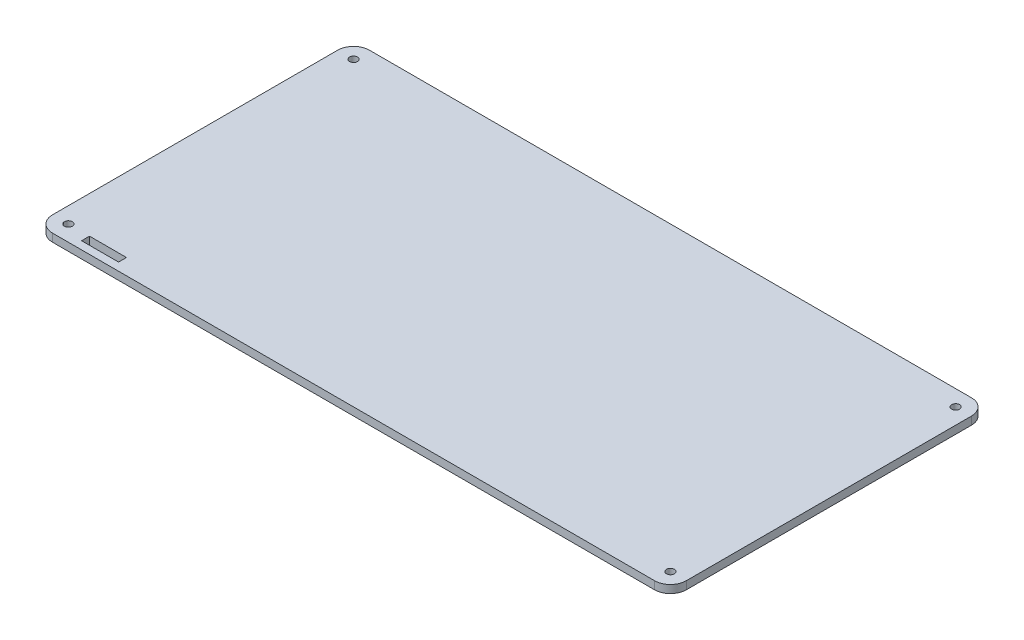
ISO-10303-21;
HEADER;
FILE_DESCRIPTION(('STEP AP214'),'2;1');
FILE_NAME('part.step','',(''),(''),'','','');
FILE_SCHEMA(('AUTOMOTIVE_DESIGN { 1 0 10303 214 1 1 1 1 }'));
ENDSEC;
DATA;
#1=APPLICATION_CONTEXT('core data for automotive mechanical design processes');
#2=APPLICATION_PROTOCOL_DEFINITION('international standard','automotive_design',2000,#1);
#3=PRODUCT_CONTEXT('',#1,'mechanical');
#4=PRODUCT('Part','Part','',(#3));
#5=PRODUCT_RELATED_PRODUCT_CATEGORY('part','',(#4));
#6=PRODUCT_DEFINITION_FORMATION('','',#4);
#7=PRODUCT_DEFINITION_CONTEXT('part definition',#1,'design');
#8=PRODUCT_DEFINITION('design','',#6,#7);
#9=PRODUCT_DEFINITION_SHAPE('','',#8);
#10=(LENGTH_UNIT() NAMED_UNIT(*) SI_UNIT(.MILLI.,.METRE.));
#11=(NAMED_UNIT(*) PLANE_ANGLE_UNIT() SI_UNIT($,.RADIAN.));
#12=(NAMED_UNIT(*) SI_UNIT($,.STERADIAN.) SOLID_ANGLE_UNIT());
#13=UNCERTAINTY_MEASURE_WITH_UNIT(LENGTH_MEASURE(1.E-05),#10,'distance_accuracy_value','');
#14=(GEOMETRIC_REPRESENTATION_CONTEXT(3) GLOBAL_UNCERTAINTY_ASSIGNED_CONTEXT((#13)) GLOBAL_UNIT_ASSIGNED_CONTEXT((#10,
#11,#12)) REPRESENTATION_CONTEXT('',''));
#15=CARTESIAN_POINT('',(0.,0.,0.));
#16=DIRECTION('',(0.,0.,1.));
#17=DIRECTION('',(1.,0.,0.));
#18=AXIS2_PLACEMENT_3D('',#15,#16,#17);
#19=CARTESIAN_POINT('',(0.,3.,0.));
#20=DIRECTION('',(0.,1.,0.));
#21=DIRECTION('',(0.,0.,1.));
#22=AXIS2_PLACEMENT_3D('',#19,#20,#21);
#23=PLANE('',#22);
#24=CARTESIAN_POINT('',(-114.,3.,54.));
#25=DIRECTION('',(0.,1.,0.));
#26=DIRECTION('',(0.,0.,1.));
#27=AXIS2_PLACEMENT_3D('',#24,#25,#26);
#28=CIRCLE('',#27,1.5);
#29=CARTESIAN_POINT('',(-114.,3.,55.5));
#30=VERTEX_POINT('',#29);
#31=EDGE_CURVE('E378',#30,#30,#28,.T.);
#32=ORIENTED_EDGE('',*,*,#31,.F.);
#33=EDGE_LOOP('',(#32));
#34=FACE_BOUND('',#33,.T.);
#35=CARTESIAN_POINT('',(-114.,3.,-54.));
#36=DIRECTION('',(0.,1.,0.));
#37=DIRECTION('',(0.,0.,1.));
#38=AXIS2_PLACEMENT_3D('',#35,#36,#37);
#39=CIRCLE('',#38,1.5);
#40=CARTESIAN_POINT('',(-114.,3.,-52.5));
#41=VERTEX_POINT('',#40);
#42=EDGE_CURVE('E158',#41,#41,#39,.T.);
#43=ORIENTED_EDGE('',*,*,#42,.F.);
#44=EDGE_LOOP('',(#43));
#45=FACE_BOUND('',#44,.T.);
#46=DIRECTION('',(-1.,0.,0.));
#47=VECTOR('',#46,1.);
#48=CARTESIAN_POINT('',(-120.,3.,-60.));
#49=LINE('',#48,#47);
#50=CARTESIAN_POINT('',(114.,3.,-60.));
#51=VERTEX_POINT('',#50);
#52=CARTESIAN_POINT('',(-114.,3.,-60.));
#53=VERTEX_POINT('',#52);
#54=EDGE_CURVE('E177',#51,#53,#49,.T.);
#55=ORIENTED_EDGE('',*,*,#54,.T.);
#56=CARTESIAN_POINT('',(-114.,3.,-54.));
#57=DIRECTION('',(0.,1.,0.));
#58=DIRECTION('',(0.,0.,1.));
#59=AXIS2_PLACEMENT_3D('',#56,#57,#58);
#60=CIRCLE('',#59,6.);
#61=CARTESIAN_POINT('',(-120.,3.,-54.));
#62=VERTEX_POINT('',#61);
#63=EDGE_CURVE('E212',#53,#62,#60,.T.);
#64=ORIENTED_EDGE('',*,*,#63,.T.);
#65=DIRECTION('',(0.,0.,1.));
#66=VECTOR('',#65,1.);
#67=CARTESIAN_POINT('',(-120.,3.,-60.));
#68=LINE('',#67,#66);
#69=CARTESIAN_POINT('',(-120.,3.,54.));
#70=VERTEX_POINT('',#69);
#71=EDGE_CURVE('E169',#62,#70,#68,.T.);
#72=ORIENTED_EDGE('',*,*,#71,.T.);
#73=CARTESIAN_POINT('',(-114.,3.,54.));
#74=DIRECTION('',(0.,1.,0.));
#75=DIRECTION('',(0.,0.,1.));
#76=AXIS2_PLACEMENT_3D('',#73,#74,#75);
#77=CIRCLE('',#76,6.);
#78=CARTESIAN_POINT('',(-114.,3.,60.));
#79=VERTEX_POINT('',#78);
#80=EDGE_CURVE('E208',#70,#79,#77,.T.);
#81=ORIENTED_EDGE('',*,*,#80,.T.);
#82=DIRECTION('',(1.,0.,0.));
#83=VECTOR('',#82,1.);
#84=CARTESIAN_POINT('',(-120.,3.,60.));
#85=LINE('',#84,#83);
#86=CARTESIAN_POINT('',(114.,3.,60.));
#87=VERTEX_POINT('',#86);
#88=EDGE_CURVE('E172',#79,#87,#85,.T.);
#89=ORIENTED_EDGE('',*,*,#88,.T.);
#90=CARTESIAN_POINT('',(114.,3.,54.));
#91=DIRECTION('',(0.,1.,0.));
#92=DIRECTION('',(0.,0.,1.));
#93=AXIS2_PLACEMENT_3D('',#90,#91,#92);
#94=CIRCLE('',#93,6.);
#95=CARTESIAN_POINT('',(120.,3.,54.));
#96=VERTEX_POINT('',#95);
#97=EDGE_CURVE('E55',#87,#96,#94,.T.);
#98=ORIENTED_EDGE('',*,*,#97,.T.);
#99=DIRECTION('',(0.,0.,-1.));
#100=VECTOR('',#99,1.);
#101=CARTESIAN_POINT('',(120.,3.,-60.));
#102=LINE('',#101,#100);
#103=CARTESIAN_POINT('',(120.,3.,-54.));
#104=VERTEX_POINT('',#103);
#105=EDGE_CURVE('E175',#96,#104,#102,.T.);
#106=ORIENTED_EDGE('',*,*,#105,.T.);
#107=CARTESIAN_POINT('',(114.,3.,-54.));
#108=DIRECTION('',(0.,1.,0.));
#109=DIRECTION('',(0.,0.,1.));
#110=AXIS2_PLACEMENT_3D('',#107,#108,#109);
#111=CIRCLE('',#110,6.);
#112=EDGE_CURVE('E210',#104,#51,#111,.T.);
#113=ORIENTED_EDGE('',*,*,#112,.T.);
#114=EDGE_LOOP('',(#55,#64,#72,#81,#89,#98,#106,#113));
#115=FACE_BOUND('',#114,.T.);
#116=DIRECTION('',(1.,0.,0.));
#117=VECTOR('',#116,1.);
#118=CARTESIAN_POINT('',(-106.,3.,57.));
#119=LINE('',#118,#117);
#120=CARTESIAN_POINT('',(-106.,3.,57.));
#121=VERTEX_POINT('',#120);
#122=CARTESIAN_POINT('',(-92.,3.,57.));
#123=VERTEX_POINT('',#122);
#124=EDGE_CURVE('E135',#121,#123,#119,.T.);
#125=ORIENTED_EDGE('',*,*,#124,.F.);
#126=DIRECTION('',(0.,0.,1.));
#127=VECTOR('',#126,1.);
#128=CARTESIAN_POINT('',(-106.,3.,54.));
#129=LINE('',#128,#127);
#130=CARTESIAN_POINT('',(-106.,3.,54.));
#131=VERTEX_POINT('',#130);
#132=EDGE_CURVE('E125',#131,#121,#129,.T.);
#133=ORIENTED_EDGE('',*,*,#132,.F.);
#134=DIRECTION('',(-1.,0.,0.));
#135=VECTOR('',#134,1.);
#136=CARTESIAN_POINT('',(-106.,3.,54.));
#137=LINE('',#136,#135);
#138=CARTESIAN_POINT('',(-92.,3.,54.));
#139=VERTEX_POINT('',#138);
#140=EDGE_CURVE('E151',#139,#131,#137,.T.);
#141=ORIENTED_EDGE('',*,*,#140,.F.);
#142=DIRECTION('',(0.,0.,-1.));
#143=VECTOR('',#142,1.);
#144=CARTESIAN_POINT('',(-92.,3.,54.));
#145=LINE('',#144,#143);
#146=EDGE_CURVE('E149',#123,#139,#145,.T.);
#147=ORIENTED_EDGE('',*,*,#146,.F.);
#148=EDGE_LOOP('',(#125,#133,#141,#147));
#149=FACE_BOUND('',#148,.T.);
#150=CARTESIAN_POINT('',(114.,3.,-54.));
#151=DIRECTION('',(0.,1.,0.));
#152=DIRECTION('',(0.,0.,1.));
#153=AXIS2_PLACEMENT_3D('',#150,#151,#152);
#154=CIRCLE('',#153,1.5);
#155=CARTESIAN_POINT('',(114.,3.,-52.5));
#156=VERTEX_POINT('',#155);
#157=EDGE_CURVE('E384',#156,#156,#154,.T.);
#158=ORIENTED_EDGE('',*,*,#157,.F.);
#159=EDGE_LOOP('',(#158));
#160=FACE_BOUND('',#159,.T.);
#161=CARTESIAN_POINT('',(114.,3.,54.));
#162=DIRECTION('',(0.,1.,0.));
#163=DIRECTION('',(0.,0.,1.));
#164=AXIS2_PLACEMENT_3D('',#161,#162,#163);
#165=CIRCLE('',#164,1.5);
#166=CARTESIAN_POINT('',(114.,3.,55.5));
#167=VERTEX_POINT('',#166);
#168=EDGE_CURVE('E369',#167,#167,#165,.T.);
#169=ORIENTED_EDGE('',*,*,#168,.F.);
#170=EDGE_LOOP('',(#169));
#171=FACE_BOUND('',#170,.T.);
#172=ADVANCED_FACE('F33',(#34,#45,#115,#149,#160,#171),#23,.T.);
#173=CARTESIAN_POINT('',(0.,0.,0.));
#174=DIRECTION('',(0.,1.,0.));
#175=DIRECTION('',(0.,0.,1.));
#176=AXIS2_PLACEMENT_3D('',#173,#174,#175);
#177=PLANE('',#176);
#178=CARTESIAN_POINT('',(-114.,0.,54.));
#179=DIRECTION('',(0.,1.,0.));
#180=DIRECTION('',(0.,0.,1.));
#181=AXIS2_PLACEMENT_3D('',#178,#179,#180);
#182=CIRCLE('',#181,1.5);
#183=CARTESIAN_POINT('',(-114.,0.,55.5));
#184=VERTEX_POINT('',#183);
#185=EDGE_CURVE('E375',#184,#184,#182,.T.);
#186=ORIENTED_EDGE('',*,*,#185,.T.);
#187=EDGE_LOOP('',(#186));
#188=FACE_BOUND('',#187,.T.);
#189=CARTESIAN_POINT('',(-114.,0.,-54.));
#190=DIRECTION('',(0.,1.,0.));
#191=DIRECTION('',(0.,0.,1.));
#192=AXIS2_PLACEMENT_3D('',#189,#190,#191);
#193=CIRCLE('',#192,1.5);
#194=CARTESIAN_POINT('',(-114.,0.,-52.5));
#195=VERTEX_POINT('',#194);
#196=EDGE_CURVE('E387',#195,#195,#193,.T.);
#197=ORIENTED_EDGE('',*,*,#196,.T.);
#198=EDGE_LOOP('',(#197));
#199=FACE_BOUND('',#198,.T.);
#200=DIRECTION('',(0.,0.,1.));
#201=VECTOR('',#200,1.);
#202=CARTESIAN_POINT('',(-120.,0.,-60.));
#203=LINE('',#202,#201);
#204=CARTESIAN_POINT('',(-120.,0.,-54.));
#205=VERTEX_POINT('',#204);
#206=CARTESIAN_POINT('',(-120.,0.,54.));
#207=VERTEX_POINT('',#206);
#208=EDGE_CURVE('E143',#205,#207,#203,.T.);
#209=ORIENTED_EDGE('',*,*,#208,.F.);
#210=CARTESIAN_POINT('',(-114.,0.,-54.));
#211=DIRECTION('',(0.,1.,0.));
#212=DIRECTION('',(0.,0.,1.));
#213=AXIS2_PLACEMENT_3D('',#210,#211,#212);
#214=CIRCLE('',#213,6.);
#215=CARTESIAN_POINT('',(-114.,0.,-60.));
#216=VERTEX_POINT('',#215);
#217=EDGE_CURVE('E200',#205,#216,#214,.F.);
#218=ORIENTED_EDGE('',*,*,#217,.T.);
#219=DIRECTION('',(-1.,0.,0.));
#220=VECTOR('',#219,1.);
#221=CARTESIAN_POINT('',(-120.,0.,-60.));
#222=LINE('',#221,#220);
#223=CARTESIAN_POINT('',(114.,0.,-60.));
#224=VERTEX_POINT('',#223);
#225=EDGE_CURVE('E173',#224,#216,#222,.T.);
#226=ORIENTED_EDGE('',*,*,#225,.F.);
#227=CARTESIAN_POINT('',(114.,0.,-54.));
#228=DIRECTION('',(0.,1.,0.));
#229=DIRECTION('',(0.,0.,1.));
#230=AXIS2_PLACEMENT_3D('',#227,#228,#229);
#231=CIRCLE('',#230,6.);
#232=CARTESIAN_POINT('',(120.,0.,-54.));
#233=VERTEX_POINT('',#232);
#234=EDGE_CURVE('E198',#224,#233,#231,.F.);
#235=ORIENTED_EDGE('',*,*,#234,.T.);
#236=DIRECTION('',(0.,0.,-1.));
#237=VECTOR('',#236,1.);
#238=CARTESIAN_POINT('',(120.,0.,-60.));
#239=LINE('',#238,#237);
#240=CARTESIAN_POINT('',(120.,0.,54.));
#241=VERTEX_POINT('',#240);
#242=EDGE_CURVE('E186',#241,#233,#239,.T.);
#243=ORIENTED_EDGE('',*,*,#242,.F.);
#244=CARTESIAN_POINT('',(114.,0.,54.));
#245=DIRECTION('',(0.,1.,0.));
#246=DIRECTION('',(0.,0.,1.));
#247=AXIS2_PLACEMENT_3D('',#244,#245,#246);
#248=CIRCLE('',#247,6.);
#249=CARTESIAN_POINT('',(114.,0.,60.));
#250=VERTEX_POINT('',#249);
#251=EDGE_CURVE('E194',#241,#250,#248,.F.);
#252=ORIENTED_EDGE('',*,*,#251,.T.);
#253=DIRECTION('',(1.,0.,0.));
#254=VECTOR('',#253,1.);
#255=CARTESIAN_POINT('',(-120.,0.,60.));
#256=LINE('',#255,#254);
#257=CARTESIAN_POINT('',(-114.,0.,60.));
#258=VERTEX_POINT('',#257);
#259=EDGE_CURVE('E183',#258,#250,#256,.T.);
#260=ORIENTED_EDGE('',*,*,#259,.F.);
#261=CARTESIAN_POINT('',(-114.,0.,54.));
#262=DIRECTION('',(0.,1.,0.));
#263=DIRECTION('',(0.,0.,1.));
#264=AXIS2_PLACEMENT_3D('',#261,#262,#263);
#265=CIRCLE('',#264,6.);
#266=EDGE_CURVE('E196',#258,#207,#265,.F.);
#267=ORIENTED_EDGE('',*,*,#266,.T.);
#268=EDGE_LOOP('',(#209,#218,#226,#235,#243,#252,#260,#267));
#269=FACE_BOUND('',#268,.T.);
#270=DIRECTION('',(0.,0.,1.));
#271=VECTOR('',#270,1.);
#272=CARTESIAN_POINT('',(-106.,0.,54.));
#273=LINE('',#272,#271);
#274=CARTESIAN_POINT('',(-106.,0.,54.));
#275=VERTEX_POINT('',#274);
#276=CARTESIAN_POINT('',(-106.,0.,57.));
#277=VERTEX_POINT('',#276);
#278=EDGE_CURVE('E156',#275,#277,#273,.T.);
#279=ORIENTED_EDGE('',*,*,#278,.T.);
#280=DIRECTION('',(1.,0.,0.));
#281=VECTOR('',#280,1.);
#282=CARTESIAN_POINT('',(-106.,0.,57.));
#283=LINE('',#282,#281);
#284=CARTESIAN_POINT('',(-92.,0.,57.));
#285=VERTEX_POINT('',#284);
#286=EDGE_CURVE('E142',#277,#285,#283,.T.);
#287=ORIENTED_EDGE('',*,*,#286,.T.);
#288=DIRECTION('',(0.,0.,-1.));
#289=VECTOR('',#288,1.);
#290=CARTESIAN_POINT('',(-92.,0.,54.));
#291=LINE('',#290,#289);
#292=CARTESIAN_POINT('',(-92.,0.,54.));
#293=VERTEX_POINT('',#292);
#294=EDGE_CURVE('E160',#285,#293,#291,.T.);
#295=ORIENTED_EDGE('',*,*,#294,.T.);
#296=DIRECTION('',(-1.,0.,0.));
#297=VECTOR('',#296,1.);
#298=CARTESIAN_POINT('',(-106.,0.,54.));
#299=LINE('',#298,#297);
#300=EDGE_CURVE('E136',#293,#275,#299,.T.);
#301=ORIENTED_EDGE('',*,*,#300,.T.);
#302=EDGE_LOOP('',(#279,#287,#295,#301));
#303=FACE_BOUND('',#302,.T.);
#304=CARTESIAN_POINT('',(114.,0.,-54.));
#305=DIRECTION('',(0.,1.,0.));
#306=DIRECTION('',(0.,0.,1.));
#307=AXIS2_PLACEMENT_3D('',#304,#305,#306);
#308=CIRCLE('',#307,1.5);
#309=CARTESIAN_POINT('',(114.,0.,-52.5));
#310=VERTEX_POINT('',#309);
#311=EDGE_CURVE('E381',#310,#310,#308,.T.);
#312=ORIENTED_EDGE('',*,*,#311,.T.);
#313=EDGE_LOOP('',(#312));
#314=FACE_BOUND('',#313,.T.);
#315=CARTESIAN_POINT('',(114.,0.,54.));
#316=DIRECTION('',(0.,1.,0.));
#317=DIRECTION('',(0.,0.,1.));
#318=AXIS2_PLACEMENT_3D('',#315,#316,#317);
#319=CIRCLE('',#318,1.5);
#320=CARTESIAN_POINT('',(114.,0.,55.5));
#321=VERTEX_POINT('',#320);
#322=EDGE_CURVE('E372',#321,#321,#319,.T.);
#323=ORIENTED_EDGE('',*,*,#322,.T.);
#324=EDGE_LOOP('',(#323));
#325=FACE_BOUND('',#324,.T.);
#326=ADVANCED_FACE('F230',(#188,#199,#269,#303,#314,#325),#177,.F.);
#327=CARTESIAN_POINT('',(-120.,3.,-60.));
#328=DIRECTION('',(1.,0.,0.));
#329=DIRECTION('',(0.,0.,-1.));
#330=AXIS2_PLACEMENT_3D('',#327,#328,#329);
#331=PLANE('',#330);
#332=ORIENTED_EDGE('',*,*,#71,.F.);
#333=DIRECTION('',(0.,-1.,0.));
#334=VECTOR('',#333,1.);
#335=CARTESIAN_POINT('',(-120.,3.,-54.));
#336=LINE('',#335,#334);
#337=EDGE_CURVE('E191',#62,#205,#336,.T.);
#338=ORIENTED_EDGE('',*,*,#337,.T.);
#339=ORIENTED_EDGE('',*,*,#208,.T.);
#340=DIRECTION('',(0.,-1.,0.));
#341=VECTOR('',#340,1.);
#342=CARTESIAN_POINT('',(-120.,3.,54.));
#343=LINE('',#342,#341);
#344=EDGE_CURVE('E180',#207,#70,#343,.F.);
#345=ORIENTED_EDGE('',*,*,#344,.T.);
#346=EDGE_LOOP('',(#332,#338,#339,#345));
#347=FACE_BOUND('',#346,.T.);
#348=ADVANCED_FACE('F247',(#347),#331,.F.);
#349=CARTESIAN_POINT('',(-120.,3.,60.));
#350=DIRECTION('',(0.,0.,-1.));
#351=DIRECTION('',(-1.,0.,0.));
#352=AXIS2_PLACEMENT_3D('',#349,#350,#351);
#353=PLANE('',#352);
#354=ORIENTED_EDGE('',*,*,#88,.F.);
#355=DIRECTION('',(0.,-1.,0.));
#356=VECTOR('',#355,1.);
#357=CARTESIAN_POINT('',(-114.,3.,60.));
#358=LINE('',#357,#356);
#359=EDGE_CURVE('E11',#79,#258,#358,.T.);
#360=ORIENTED_EDGE('',*,*,#359,.T.);
#361=ORIENTED_EDGE('',*,*,#259,.T.);
#362=DIRECTION('',(0.,-1.,0.));
#363=VECTOR('',#362,1.);
#364=CARTESIAN_POINT('',(114.,3.,60.));
#365=LINE('',#364,#363);
#366=EDGE_CURVE('E41',#250,#87,#365,.F.);
#367=ORIENTED_EDGE('',*,*,#366,.T.);
#368=EDGE_LOOP('',(#354,#360,#361,#367));
#369=FACE_BOUND('',#368,.T.);
#370=ADVANCED_FACE('F220',(#369),#353,.F.);
#371=CARTESIAN_POINT('',(120.,3.,-60.));
#372=DIRECTION('',(-1.,0.,0.));
#373=DIRECTION('',(0.,0.,1.));
#374=AXIS2_PLACEMENT_3D('',#371,#372,#373);
#375=PLANE('',#374);
#376=ORIENTED_EDGE('',*,*,#242,.T.);
#377=DIRECTION('',(0.,-1.,0.));
#378=VECTOR('',#377,1.);
#379=CARTESIAN_POINT('',(120.,3.,-54.));
#380=LINE('',#379,#378);
#381=EDGE_CURVE('E48',#233,#104,#380,.F.);
#382=ORIENTED_EDGE('',*,*,#381,.T.);
#383=ORIENTED_EDGE('',*,*,#105,.F.);
#384=DIRECTION('',(0.,-1.,0.));
#385=VECTOR('',#384,1.);
#386=CARTESIAN_POINT('',(120.,3.,54.));
#387=LINE('',#386,#385);
#388=EDGE_CURVE('E214',#96,#241,#387,.T.);
#389=ORIENTED_EDGE('',*,*,#388,.T.);
#390=EDGE_LOOP('',(#376,#382,#383,#389));
#391=FACE_BOUND('',#390,.T.);
#392=ADVANCED_FACE('F227',(#391),#375,.F.);
#393=CARTESIAN_POINT('',(-120.,3.,-60.));
#394=DIRECTION('',(0.,0.,1.));
#395=DIRECTION('',(1.,0.,0.));
#396=AXIS2_PLACEMENT_3D('',#393,#394,#395);
#397=PLANE('',#396);
#398=ORIENTED_EDGE('',*,*,#225,.T.);
#399=DIRECTION('',(0.,-1.,0.));
#400=VECTOR('',#399,1.);
#401=CARTESIAN_POINT('',(-114.,3.,-60.));
#402=LINE('',#401,#400);
#403=EDGE_CURVE('E205',#216,#53,#402,.F.);
#404=ORIENTED_EDGE('',*,*,#403,.T.);
#405=ORIENTED_EDGE('',*,*,#54,.F.);
#406=DIRECTION('',(0.,-1.,0.));
#407=VECTOR('',#406,1.);
#408=CARTESIAN_POINT('',(114.,3.,-60.));
#409=LINE('',#408,#407);
#410=EDGE_CURVE('E202',#51,#224,#409,.T.);
#411=ORIENTED_EDGE('',*,*,#410,.T.);
#412=EDGE_LOOP('',(#398,#404,#405,#411));
#413=FACE_BOUND('',#412,.T.);
#414=ADVANCED_FACE('F239',(#413),#397,.F.);
#415=CARTESIAN_POINT('',(-106.,3.,54.));
#416=DIRECTION('',(1.,0.,0.));
#417=DIRECTION('',(0.,0.,-1.));
#418=AXIS2_PLACEMENT_3D('',#415,#416,#417);
#419=PLANE('',#418);
#420=ORIENTED_EDGE('',*,*,#278,.F.);
#421=DIRECTION('',(0.,-1.,0.));
#422=VECTOR('',#421,1.);
#423=CARTESIAN_POINT('',(-106.,3.,54.));
#424=LINE('',#423,#422);
#425=EDGE_CURVE('E131',#131,#275,#424,.T.);
#426=ORIENTED_EDGE('',*,*,#425,.F.);
#427=ORIENTED_EDGE('',*,*,#132,.T.);
#428=DIRECTION('',(0.,-1.,0.));
#429=VECTOR('',#428,1.);
#430=CARTESIAN_POINT('',(-106.,3.,57.));
#431=LINE('',#430,#429);
#432=EDGE_CURVE('E128',#121,#277,#431,.T.);
#433=ORIENTED_EDGE('',*,*,#432,.T.);
#434=EDGE_LOOP('',(#420,#426,#427,#433));
#435=FACE_BOUND('',#434,.T.);
#436=ADVANCED_FACE('F127',(#435),#419,.T.);
#437=CARTESIAN_POINT('',(-106.,3.,57.));
#438=DIRECTION('',(0.,0.,-1.));
#439=DIRECTION('',(-1.,0.,0.));
#440=AXIS2_PLACEMENT_3D('',#437,#438,#439);
#441=PLANE('',#440);
#442=ORIENTED_EDGE('',*,*,#286,.F.);
#443=ORIENTED_EDGE('',*,*,#432,.F.);
#444=ORIENTED_EDGE('',*,*,#124,.T.);
#445=DIRECTION('',(0.,-1.,0.));
#446=VECTOR('',#445,1.);
#447=CARTESIAN_POINT('',(-92.,3.,57.));
#448=LINE('',#447,#446);
#449=EDGE_CURVE('E144',#123,#285,#448,.T.);
#450=ORIENTED_EDGE('',*,*,#449,.T.);
#451=EDGE_LOOP('',(#442,#443,#444,#450));
#452=FACE_BOUND('',#451,.T.);
#453=ADVANCED_FACE('F139',(#452),#441,.T.);
#454=CARTESIAN_POINT('',(-92.,3.,54.));
#455=DIRECTION('',(-1.,0.,0.));
#456=DIRECTION('',(0.,0.,1.));
#457=AXIS2_PLACEMENT_3D('',#454,#455,#456);
#458=PLANE('',#457);
#459=ORIENTED_EDGE('',*,*,#294,.F.);
#460=ORIENTED_EDGE('',*,*,#449,.F.);
#461=ORIENTED_EDGE('',*,*,#146,.T.);
#462=DIRECTION('',(0.,-1.,0.));
#463=VECTOR('',#462,1.);
#464=CARTESIAN_POINT('',(-92.,3.,54.));
#465=LINE('',#464,#463);
#466=EDGE_CURVE('E166',#139,#293,#465,.T.);
#467=ORIENTED_EDGE('',*,*,#466,.T.);
#468=EDGE_LOOP('',(#459,#460,#461,#467));
#469=FACE_BOUND('',#468,.T.);
#470=ADVANCED_FACE('F284',(#469),#458,.T.);
#471=CARTESIAN_POINT('',(-106.,3.,54.));
#472=DIRECTION('',(0.,0.,1.));
#473=DIRECTION('',(1.,0.,0.));
#474=AXIS2_PLACEMENT_3D('',#471,#472,#473);
#475=PLANE('',#474);
#476=ORIENTED_EDGE('',*,*,#300,.F.);
#477=ORIENTED_EDGE('',*,*,#466,.F.);
#478=ORIENTED_EDGE('',*,*,#140,.T.);
#479=ORIENTED_EDGE('',*,*,#425,.T.);
#480=EDGE_LOOP('',(#476,#477,#478,#479));
#481=FACE_BOUND('',#480,.T.);
#482=ADVANCED_FACE('F280',(#481),#475,.T.);
#483=CARTESIAN_POINT('',(-114.,3.,-54.));
#484=DIRECTION('',(0.,-1.,0.));
#485=DIRECTION('',(0.,0.,-1.));
#486=AXIS2_PLACEMENT_3D('',#483,#484,#485);
#487=CYLINDRICAL_SURFACE('',#486,6.);
#488=ORIENTED_EDGE('',*,*,#63,.F.);
#489=ORIENTED_EDGE('',*,*,#403,.F.);
#490=ORIENTED_EDGE('',*,*,#217,.F.);
#491=ORIENTED_EDGE('',*,*,#337,.F.);
#492=EDGE_LOOP('',(#488,#489,#490,#491));
#493=FACE_BOUND('',#492,.T.);
#494=ADVANCED_FACE('F245',(#493),#487,.T.);
#495=CARTESIAN_POINT('',(114.,3.,-54.));
#496=DIRECTION('',(0.,-1.,0.));
#497=DIRECTION('',(0.,0.,-1.));
#498=AXIS2_PLACEMENT_3D('',#495,#496,#497);
#499=CYLINDRICAL_SURFACE('',#498,6.);
#500=ORIENTED_EDGE('',*,*,#112,.F.);
#501=ORIENTED_EDGE('',*,*,#381,.F.);
#502=ORIENTED_EDGE('',*,*,#234,.F.);
#503=ORIENTED_EDGE('',*,*,#410,.F.);
#504=EDGE_LOOP('',(#500,#501,#502,#503));
#505=FACE_BOUND('',#504,.T.);
#506=ADVANCED_FACE('F236',(#505),#499,.T.);
#507=CARTESIAN_POINT('',(-114.,3.,54.));
#508=DIRECTION('',(0.,-1.,0.));
#509=DIRECTION('',(0.,0.,-1.));
#510=AXIS2_PLACEMENT_3D('',#507,#508,#509);
#511=CYLINDRICAL_SURFACE('',#510,6.);
#512=ORIENTED_EDGE('',*,*,#80,.F.);
#513=ORIENTED_EDGE('',*,*,#344,.F.);
#514=ORIENTED_EDGE('',*,*,#266,.F.);
#515=ORIENTED_EDGE('',*,*,#359,.F.);
#516=EDGE_LOOP('',(#512,#513,#514,#515));
#517=FACE_BOUND('',#516,.T.);
#518=ADVANCED_FACE('F250',(#517),#511,.T.);
#519=CARTESIAN_POINT('',(114.,3.,54.));
#520=DIRECTION('',(0.,-1.,0.));
#521=DIRECTION('',(0.,0.,-1.));
#522=AXIS2_PLACEMENT_3D('',#519,#520,#521);
#523=CYLINDRICAL_SURFACE('',#522,6.);
#524=ORIENTED_EDGE('',*,*,#97,.F.);
#525=ORIENTED_EDGE('',*,*,#366,.F.);
#526=ORIENTED_EDGE('',*,*,#251,.F.);
#527=ORIENTED_EDGE('',*,*,#388,.F.);
#528=EDGE_LOOP('',(#524,#525,#526,#527));
#529=FACE_BOUND('',#528,.T.);
#530=ADVANCED_FACE('F35',(#529),#523,.T.);
#531=CARTESIAN_POINT('',(-114.,3.,-54.));
#532=DIRECTION('',(0.,-1.,0.));
#533=DIRECTION('',(0.,0.,-1.));
#534=AXIS2_PLACEMENT_3D('',#531,#532,#533);
#535=CYLINDRICAL_SURFACE('',#534,1.5);
#536=ORIENTED_EDGE('',*,*,#42,.T.);
#537=EDGE_LOOP('',(#536));
#538=FACE_BOUND('',#537,.T.);
#539=ORIENTED_EDGE('',*,*,#196,.F.);
#540=EDGE_LOOP('',(#539));
#541=FACE_BOUND('',#540,.T.);
#542=ADVANCED_FACE('F256',(#538,#541),#535,.F.);
#543=CARTESIAN_POINT('',(114.,3.,-54.));
#544=DIRECTION('',(0.,-1.,0.));
#545=DIRECTION('',(0.,0.,-1.));
#546=AXIS2_PLACEMENT_3D('',#543,#544,#545);
#547=CYLINDRICAL_SURFACE('',#546,1.5);
#548=ORIENTED_EDGE('',*,*,#157,.T.);
#549=EDGE_LOOP('',(#548));
#550=FACE_BOUND('',#549,.T.);
#551=ORIENTED_EDGE('',*,*,#311,.F.);
#552=EDGE_LOOP('',(#551));
#553=FACE_BOUND('',#552,.T.);
#554=ADVANCED_FACE('F334',(#550,#553),#547,.F.);
#555=CARTESIAN_POINT('',(-114.,3.,54.));
#556=DIRECTION('',(0.,-1.,0.));
#557=DIRECTION('',(0.,0.,-1.));
#558=AXIS2_PLACEMENT_3D('',#555,#556,#557);
#559=CYLINDRICAL_SURFACE('',#558,1.5);
#560=ORIENTED_EDGE('',*,*,#31,.T.);
#561=EDGE_LOOP('',(#560));
#562=FACE_BOUND('',#561,.T.);
#563=ORIENTED_EDGE('',*,*,#185,.F.);
#564=EDGE_LOOP('',(#563));
#565=FACE_BOUND('',#564,.T.);
#566=ADVANCED_FACE('F343',(#562,#565),#559,.F.);
#567=CARTESIAN_POINT('',(114.,3.,54.));
#568=DIRECTION('',(0.,-1.,0.));
#569=DIRECTION('',(0.,0.,-1.));
#570=AXIS2_PLACEMENT_3D('',#567,#568,#569);
#571=CYLINDRICAL_SURFACE('',#570,1.5);
#572=ORIENTED_EDGE('',*,*,#168,.T.);
#573=EDGE_LOOP('',(#572));
#574=FACE_BOUND('',#573,.T.);
#575=ORIENTED_EDGE('',*,*,#322,.F.);
#576=EDGE_LOOP('',(#575));
#577=FACE_BOUND('',#576,.T.);
#578=ADVANCED_FACE('F352',(#574,#577),#571,.F.);
#579=CLOSED_SHELL('',(#172,#326,#348,#370,#392,#414,#436,#453,#470,#482,#494,#506,#518,#530,
#542,#554,#566,#578));
#580=MANIFOLD_SOLID_BREP('B2',#579);
#581=ADVANCED_BREP_SHAPE_REPRESENTATION('',(#18,#580),#14);
#582=SHAPE_DEFINITION_REPRESENTATION(#9,#581);
ENDSEC;
END-ISO-10303-21;
